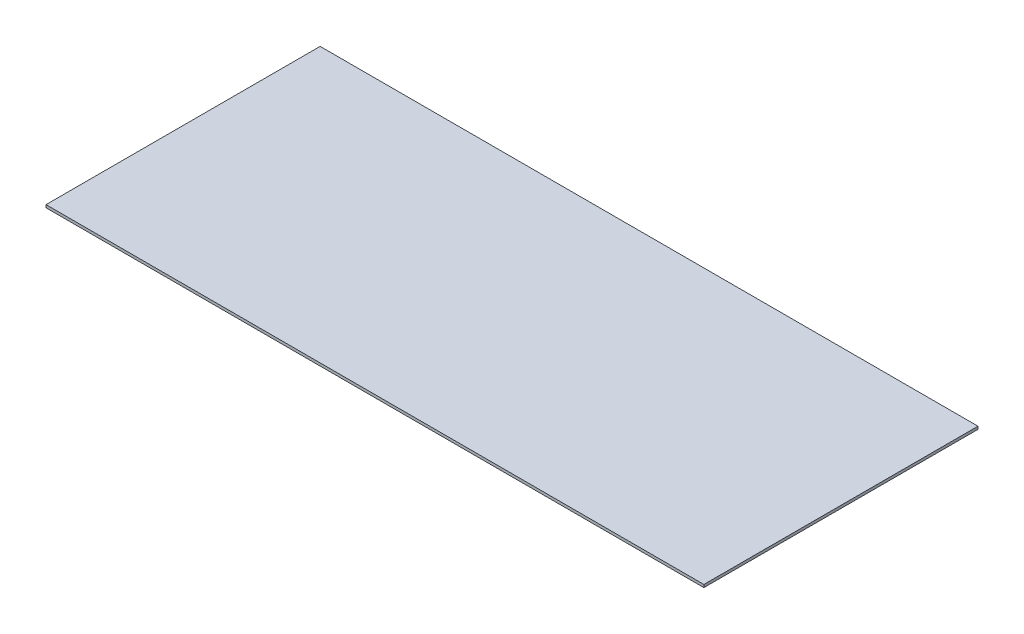
ISO-10303-21;
HEADER;
FILE_DESCRIPTION(('STEP AP214'),'2;1');
FILE_NAME('part.step','',(''),(''),'','','');
FILE_SCHEMA(('AUTOMOTIVE_DESIGN { 1 0 10303 214 1 1 1 1 }'));
ENDSEC;
DATA;
#1=APPLICATION_CONTEXT('core data for automotive mechanical design processes');
#2=APPLICATION_PROTOCOL_DEFINITION('international standard','automotive_design',2000,#1);
#3=PRODUCT_CONTEXT('',#1,'mechanical');
#4=PRODUCT('Part','Part','',(#3));
#5=PRODUCT_RELATED_PRODUCT_CATEGORY('part','',(#4));
#6=PRODUCT_DEFINITION_FORMATION('','',#4);
#7=PRODUCT_DEFINITION_CONTEXT('part definition',#1,'design');
#8=PRODUCT_DEFINITION('design','',#6,#7);
#9=PRODUCT_DEFINITION_SHAPE('','',#8);
#10=(LENGTH_UNIT() NAMED_UNIT(*) SI_UNIT(.MILLI.,.METRE.));
#11=(NAMED_UNIT(*) PLANE_ANGLE_UNIT() SI_UNIT($,.RADIAN.));
#12=(NAMED_UNIT(*) SI_UNIT($,.STERADIAN.) SOLID_ANGLE_UNIT());
#13=UNCERTAINTY_MEASURE_WITH_UNIT(LENGTH_MEASURE(1.E-05),#10,'distance_accuracy_value','');
#14=(GEOMETRIC_REPRESENTATION_CONTEXT(3) GLOBAL_UNCERTAINTY_ASSIGNED_CONTEXT((#13)) GLOBAL_UNIT_ASSIGNED_CONTEXT((#10,
#11,#12)) REPRESENTATION_CONTEXT('',''));
#15=CARTESIAN_POINT('',(0.,0.,0.));
#16=DIRECTION('',(0.,0.,1.));
#17=DIRECTION('',(1.,0.,0.));
#18=AXIS2_PLACEMENT_3D('',#15,#16,#17);
#19=CARTESIAN_POINT('',(600.,5.00000000000021,500.));
#20=DIRECTION('',(1.,0.,0.));
#21=DIRECTION('',(0.,0.,-1.));
#22=AXIS2_PLACEMENT_3D('',#19,#20,#21);
#23=PLANE('',#22);
#24=DIRECTION('',(0.,-1.,0.));
#25=VECTOR('',#24,1.);
#26=CARTESIAN_POINT('',(600.,5.00000000000021,0.));
#27=LINE('',#26,#25);
#28=CARTESIAN_POINT('',(600.,5.00000000000021,0.));
#29=VERTEX_POINT('',#28);
#30=CARTESIAN_POINT('',(600.,2.14313189850787E-13,0.));
#31=VERTEX_POINT('',#30);
#32=EDGE_CURVE('E99',#29,#31,#27,.T.);
#33=ORIENTED_EDGE('',*,*,#32,.F.);
#34=DIRECTION('',(0.,0.,-1.));
#35=VECTOR('',#34,1.);
#36=CARTESIAN_POINT('',(600.,5.00000000000021,500.));
#37=LINE('',#36,#35);
#38=CARTESIAN_POINT('',(600.,5.00000000000021,500.));
#39=VERTEX_POINT('',#38);
#40=EDGE_CURVE('E11',#39,#29,#37,.T.);
#41=ORIENTED_EDGE('',*,*,#40,.F.);
#42=DIRECTION('',(0.,-1.,0.));
#43=VECTOR('',#42,1.);
#44=CARTESIAN_POINT('',(600.,5.00000000000021,500.));
#45=LINE('',#44,#43);
#46=CARTESIAN_POINT('',(600.,2.14313189850787E-13,500.));
#47=VERTEX_POINT('',#46);
#48=EDGE_CURVE('E93',#39,#47,#45,.T.);
#49=ORIENTED_EDGE('',*,*,#48,.T.);
#50=DIRECTION('',(0.,0.,-1.));
#51=VECTOR('',#50,1.);
#52=CARTESIAN_POINT('',(600.,2.14313189850787E-13,500.));
#53=LINE('',#52,#51);
#54=EDGE_CURVE('E38',#47,#31,#53,.T.);
#55=ORIENTED_EDGE('',*,*,#54,.T.);
#56=EDGE_LOOP('',(#33,#41,#49,#55));
#57=FACE_BOUND('',#56,.T.);
#58=ADVANCED_FACE('F35',(#57),#23,.T.);
#59=CARTESIAN_POINT('',(-600.,4.99999999999985,500.));
#60=DIRECTION('',(0.,1.,0.));
#61=DIRECTION('',(-1.,0.,0.));
#62=AXIS2_PLACEMENT_3D('',#59,#60,#61);
#63=PLANE('',#62);
#64=DIRECTION('',(1.,0.,0.));
#65=VECTOR('',#64,1.);
#66=CARTESIAN_POINT('',(-600.,4.99999999999985,0.));
#67=LINE('',#66,#65);
#68=CARTESIAN_POINT('',(-600.,4.99999999999985,0.));
#69=VERTEX_POINT('',#68);
#70=EDGE_CURVE('E95',#69,#29,#67,.T.);
#71=ORIENTED_EDGE('',*,*,#70,.F.);
#72=DIRECTION('',(0.,0.,-1.));
#73=VECTOR('',#72,1.);
#74=CARTESIAN_POINT('',(-600.,4.99999999999985,500.));
#75=LINE('',#74,#73);
#76=CARTESIAN_POINT('',(-600.,4.99999999999985,500.));
#77=VERTEX_POINT('',#76);
#78=EDGE_CURVE('E44',#77,#69,#75,.T.);
#79=ORIENTED_EDGE('',*,*,#78,.F.);
#80=DIRECTION('',(1.,0.,0.));
#81=VECTOR('',#80,1.);
#82=CARTESIAN_POINT('',(-600.,4.99999999999985,500.));
#83=LINE('',#82,#81);
#84=EDGE_CURVE('E90',#77,#39,#83,.T.);
#85=ORIENTED_EDGE('',*,*,#84,.T.);
#86=ORIENTED_EDGE('',*,*,#40,.T.);
#87=EDGE_LOOP('',(#71,#79,#85,#86));
#88=FACE_BOUND('',#87,.T.);
#89=ADVANCED_FACE('F109',(#88),#63,.T.);
#90=CARTESIAN_POINT('',(-600.,-1.53080849893419E-13,500.));
#91=DIRECTION('',(-1.,0.,0.));
#92=DIRECTION('',(0.,0.,1.));
#93=AXIS2_PLACEMENT_3D('',#90,#91,#92);
#94=PLANE('',#93);
#95=DIRECTION('',(0.,1.,0.));
#96=VECTOR('',#95,1.);
#97=CARTESIAN_POINT('',(-600.,-1.53080849893419E-13,0.));
#98=LINE('',#97,#96);
#99=CARTESIAN_POINT('',(-600.,-1.53080849893419E-13,0.));
#100=VERTEX_POINT('',#99);
#101=EDGE_CURVE('E85',#100,#69,#98,.T.);
#102=ORIENTED_EDGE('',*,*,#101,.F.);
#103=DIRECTION('',(0.,0.,-1.));
#104=VECTOR('',#103,1.);
#105=CARTESIAN_POINT('',(-600.,-1.53080849893419E-13,500.));
#106=LINE('',#105,#104);
#107=CARTESIAN_POINT('',(-600.,-1.53080849893419E-13,500.));
#108=VERTEX_POINT('',#107);
#109=EDGE_CURVE('E80',#108,#100,#106,.T.);
#110=ORIENTED_EDGE('',*,*,#109,.F.);
#111=DIRECTION('',(0.,1.,0.));
#112=VECTOR('',#111,1.);
#113=CARTESIAN_POINT('',(-600.,-1.53080849893419E-13,500.));
#114=LINE('',#113,#112);
#115=EDGE_CURVE('E83',#108,#77,#114,.T.);
#116=ORIENTED_EDGE('',*,*,#115,.T.);
#117=ORIENTED_EDGE('',*,*,#78,.T.);
#118=EDGE_LOOP('',(#102,#110,#116,#117));
#119=FACE_BOUND('',#118,.T.);
#120=ADVANCED_FACE('F82',(#119),#94,.T.);
#121=CARTESIAN_POINT('',(600.,2.14313189850787E-13,500.));
#122=DIRECTION('',(0.,-1.,0.));
#123=DIRECTION('',(1.,0.,0.));
#124=AXIS2_PLACEMENT_3D('',#121,#122,#123);
#125=PLANE('',#124);
#126=DIRECTION('',(-1.,0.,0.));
#127=VECTOR('',#126,1.);
#128=CARTESIAN_POINT('',(600.,2.14313189850787E-13,0.));
#129=LINE('',#128,#127);
#130=EDGE_CURVE('E102',#31,#100,#129,.T.);
#131=ORIENTED_EDGE('',*,*,#130,.F.);
#132=ORIENTED_EDGE('',*,*,#54,.F.);
#133=DIRECTION('',(-1.,0.,0.));
#134=VECTOR('',#133,1.);
#135=CARTESIAN_POINT('',(600.,2.14313189850787E-13,500.));
#136=LINE('',#135,#134);
#137=EDGE_CURVE('E89',#47,#108,#136,.T.);
#138=ORIENTED_EDGE('',*,*,#137,.T.);
#139=ORIENTED_EDGE('',*,*,#109,.T.);
#140=EDGE_LOOP('',(#131,#132,#138,#139));
#141=FACE_BOUND('',#140,.T.);
#142=ADVANCED_FACE('F92',(#141),#125,.T.);
#143=CARTESIAN_POINT('',(0.,0.,500.));
#144=DIRECTION('',(0.,0.,-1.));
#145=DIRECTION('',(-1.,0.,0.));
#146=AXIS2_PLACEMENT_3D('',#143,#144,#145);
#147=PLANE('',#146);
#148=ORIENTED_EDGE('',*,*,#48,.F.);
#149=ORIENTED_EDGE('',*,*,#84,.F.);
#150=ORIENTED_EDGE('',*,*,#115,.F.);
#151=ORIENTED_EDGE('',*,*,#137,.F.);
#152=EDGE_LOOP('',(#148,#149,#150,#151));
#153=FACE_BOUND('',#152,.T.);
#154=ADVANCED_FACE('F88',(#153),#147,.F.);
#155=CARTESIAN_POINT('',(0.,0.,0.));
#156=DIRECTION('',(0.,0.,-1.));
#157=DIRECTION('',(-1.,0.,0.));
#158=AXIS2_PLACEMENT_3D('',#155,#156,#157);
#159=PLANE('',#158);
#160=ORIENTED_EDGE('',*,*,#32,.T.);
#161=ORIENTED_EDGE('',*,*,#130,.T.);
#162=ORIENTED_EDGE('',*,*,#101,.T.);
#163=ORIENTED_EDGE('',*,*,#70,.T.);
#164=EDGE_LOOP('',(#160,#161,#162,#163));
#165=FACE_BOUND('',#164,.T.);
#166=ADVANCED_FACE('F108',(#165),#159,.T.);
#167=CLOSED_SHELL('',(#58,#89,#120,#142,#154,#166));
#168=MANIFOLD_SOLID_BREP('B2',#167);
#169=ADVANCED_BREP_SHAPE_REPRESENTATION('',(#18,#168),#14);
#170=SHAPE_DEFINITION_REPRESENTATION(#9,#169);
ENDSEC;
END-ISO-10303-21;
